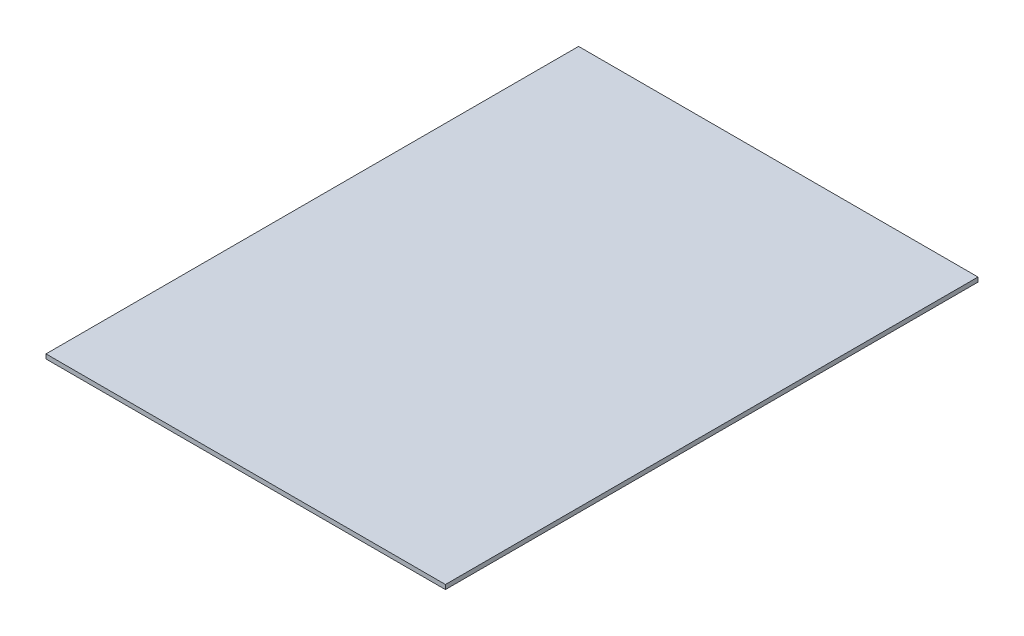
ISO-10303-21;
HEADER;
FILE_DESCRIPTION(('STEP AP214'),'2;1');
FILE_NAME('part.step','',(''),(''),'','','');
FILE_SCHEMA(('AUTOMOTIVE_DESIGN { 1 0 10303 214 1 1 1 1 }'));
ENDSEC;
DATA;
#1=APPLICATION_CONTEXT('core data for automotive mechanical design processes');
#2=APPLICATION_PROTOCOL_DEFINITION('international standard','automotive_design',2000,#1);
#3=PRODUCT_CONTEXT('',#1,'mechanical');
#4=PRODUCT('Part','Part','',(#3));
#5=PRODUCT_RELATED_PRODUCT_CATEGORY('part','',(#4));
#6=PRODUCT_DEFINITION_FORMATION('','',#4);
#7=PRODUCT_DEFINITION_CONTEXT('part definition',#1,'design');
#8=PRODUCT_DEFINITION('design','',#6,#7);
#9=PRODUCT_DEFINITION_SHAPE('','',#8);
#10=(LENGTH_UNIT() NAMED_UNIT(*) SI_UNIT(.MILLI.,.METRE.));
#11=(NAMED_UNIT(*) PLANE_ANGLE_UNIT() SI_UNIT($,.RADIAN.));
#12=(NAMED_UNIT(*) SI_UNIT($,.STERADIAN.) SOLID_ANGLE_UNIT());
#13=UNCERTAINTY_MEASURE_WITH_UNIT(LENGTH_MEASURE(1.E-05),#10,'distance_accuracy_value','');
#14=(GEOMETRIC_REPRESENTATION_CONTEXT(3) GLOBAL_UNCERTAINTY_ASSIGNED_CONTEXT((#13)) GLOBAL_UNIT_ASSIGNED_CONTEXT((#10,
#11,#12)) REPRESENTATION_CONTEXT('',''));
#15=CARTESIAN_POINT('',(0.,0.,0.));
#16=DIRECTION('',(0.,0.,1.));
#17=DIRECTION('',(1.,0.,0.));
#18=AXIS2_PLACEMENT_3D('',#15,#16,#17);
#19=CARTESIAN_POINT('',(-45.,1.,60.));
#20=DIRECTION('',(1.,0.,0.));
#21=DIRECTION('',(0.,0.,-1.));
#22=AXIS2_PLACEMENT_3D('',#19,#20,#21);
#23=PLANE('',#22);
#24=DIRECTION('',(0.,0.,1.));
#25=VECTOR('',#24,1.);
#26=CARTESIAN_POINT('',(-45.,0.,60.));
#27=LINE('',#26,#25);
#28=CARTESIAN_POINT('',(-45.,0.,-60.));
#29=VERTEX_POINT('',#28);
#30=CARTESIAN_POINT('',(-45.,0.,60.));
#31=VERTEX_POINT('',#30);
#32=EDGE_CURVE('E107',#29,#31,#27,.T.);
#33=ORIENTED_EDGE('',*,*,#32,.T.);
#34=DIRECTION('',(0.,-1.,0.));
#35=VECTOR('',#34,1.);
#36=CARTESIAN_POINT('',(-45.,1.,60.));
#37=LINE('',#36,#35);
#38=CARTESIAN_POINT('',(-45.,1.,60.));
#39=VERTEX_POINT('',#38);
#40=EDGE_CURVE('E11',#39,#31,#37,.T.);
#41=ORIENTED_EDGE('',*,*,#40,.F.);
#42=DIRECTION('',(0.,0.,1.));
#43=VECTOR('',#42,1.);
#44=CARTESIAN_POINT('',(-45.,1.,60.));
#45=LINE('',#44,#43);
#46=CARTESIAN_POINT('',(-45.,1.,-60.));
#47=VERTEX_POINT('',#46);
#48=EDGE_CURVE('E91',#47,#39,#45,.T.);
#49=ORIENTED_EDGE('',*,*,#48,.F.);
#50=DIRECTION('',(0.,-1.,0.));
#51=VECTOR('',#50,1.);
#52=CARTESIAN_POINT('',(-45.,1.,-60.));
#53=LINE('',#52,#51);
#54=EDGE_CURVE('E103',#47,#29,#53,.T.);
#55=ORIENTED_EDGE('',*,*,#54,.T.);
#56=EDGE_LOOP('',(#33,#41,#49,#55));
#57=FACE_BOUND('',#56,.T.);
#58=ADVANCED_FACE('F39',(#57),#23,.F.);
#59=CARTESIAN_POINT('',(45.,1.,60.));
#60=DIRECTION('',(0.,0.,-1.));
#61=DIRECTION('',(-1.,0.,0.));
#62=AXIS2_PLACEMENT_3D('',#59,#60,#61);
#63=PLANE('',#62);
#64=DIRECTION('',(1.,0.,0.));
#65=VECTOR('',#64,1.);
#66=CARTESIAN_POINT('',(45.,0.,60.));
#67=LINE('',#66,#65);
#68=CARTESIAN_POINT('',(45.,0.,60.));
#69=VERTEX_POINT('',#68);
#70=EDGE_CURVE('E96',#31,#69,#67,.T.);
#71=ORIENTED_EDGE('',*,*,#70,.T.);
#72=DIRECTION('',(0.,-1.,0.));
#73=VECTOR('',#72,1.);
#74=CARTESIAN_POINT('',(45.,1.,60.));
#75=LINE('',#74,#73);
#76=CARTESIAN_POINT('',(45.,1.,60.));
#77=VERTEX_POINT('',#76);
#78=EDGE_CURVE('E48',#77,#69,#75,.T.);
#79=ORIENTED_EDGE('',*,*,#78,.F.);
#80=DIRECTION('',(1.,0.,0.));
#81=VECTOR('',#80,1.);
#82=CARTESIAN_POINT('',(45.,1.,60.));
#83=LINE('',#82,#81);
#84=EDGE_CURVE('E86',#39,#77,#83,.T.);
#85=ORIENTED_EDGE('',*,*,#84,.F.);
#86=ORIENTED_EDGE('',*,*,#40,.T.);
#87=EDGE_LOOP('',(#71,#79,#85,#86));
#88=FACE_BOUND('',#87,.T.);
#89=ADVANCED_FACE('F95',(#88),#63,.F.);
#90=CARTESIAN_POINT('',(45.,1.,60.));
#91=DIRECTION('',(-1.,0.,0.));
#92=DIRECTION('',(0.,0.,1.));
#93=AXIS2_PLACEMENT_3D('',#90,#91,#92);
#94=PLANE('',#93);
#95=DIRECTION('',(0.,0.,-1.));
#96=VECTOR('',#95,1.);
#97=CARTESIAN_POINT('',(45.,0.,60.));
#98=LINE('',#97,#96);
#99=CARTESIAN_POINT('',(45.,0.,-60.));
#100=VERTEX_POINT('',#99);
#101=EDGE_CURVE('E73',#69,#100,#98,.T.);
#102=ORIENTED_EDGE('',*,*,#101,.T.);
#103=DIRECTION('',(0.,-1.,0.));
#104=VECTOR('',#103,1.);
#105=CARTESIAN_POINT('',(45.,1.,-60.));
#106=LINE('',#105,#104);
#107=CARTESIAN_POINT('',(45.,1.,-60.));
#108=VERTEX_POINT('',#107);
#109=EDGE_CURVE('E98',#108,#100,#106,.T.);
#110=ORIENTED_EDGE('',*,*,#109,.F.);
#111=DIRECTION('',(0.,0.,-1.));
#112=VECTOR('',#111,1.);
#113=CARTESIAN_POINT('',(45.,1.,60.));
#114=LINE('',#113,#112);
#115=EDGE_CURVE('E89',#77,#108,#114,.T.);
#116=ORIENTED_EDGE('',*,*,#115,.F.);
#117=ORIENTED_EDGE('',*,*,#78,.T.);
#118=EDGE_LOOP('',(#102,#110,#116,#117));
#119=FACE_BOUND('',#118,.T.);
#120=ADVANCED_FACE('F99',(#119),#94,.F.);
#121=CARTESIAN_POINT('',(45.,1.,-60.));
#122=DIRECTION('',(0.,0.,1.));
#123=DIRECTION('',(1.,0.,0.));
#124=AXIS2_PLACEMENT_3D('',#121,#122,#123);
#125=PLANE('',#124);
#126=DIRECTION('',(-1.,0.,0.));
#127=VECTOR('',#126,1.);
#128=CARTESIAN_POINT('',(45.,0.,-60.));
#129=LINE('',#128,#127);
#130=EDGE_CURVE('E79',#100,#29,#129,.T.);
#131=ORIENTED_EDGE('',*,*,#130,.T.);
#132=ORIENTED_EDGE('',*,*,#54,.F.);
#133=DIRECTION('',(-1.,0.,0.));
#134=VECTOR('',#133,1.);
#135=CARTESIAN_POINT('',(45.,1.,-60.));
#136=LINE('',#135,#134);
#137=EDGE_CURVE('E56',#108,#47,#136,.T.);
#138=ORIENTED_EDGE('',*,*,#137,.F.);
#139=ORIENTED_EDGE('',*,*,#109,.T.);
#140=EDGE_LOOP('',(#131,#132,#138,#139));
#141=FACE_BOUND('',#140,.T.);
#142=ADVANCED_FACE('F120',(#141),#125,.F.);
#143=CARTESIAN_POINT('',(0.,1.,0.));
#144=DIRECTION('',(0.,1.,0.));
#145=DIRECTION('',(0.,0.,1.));
#146=AXIS2_PLACEMENT_3D('',#143,#144,#145);
#147=PLANE('',#146);
#148=ORIENTED_EDGE('',*,*,#48,.T.);
#149=ORIENTED_EDGE('',*,*,#84,.T.);
#150=ORIENTED_EDGE('',*,*,#115,.T.);
#151=ORIENTED_EDGE('',*,*,#137,.T.);
#152=EDGE_LOOP('',(#148,#149,#150,#151));
#153=FACE_BOUND('',#152,.T.);
#154=ADVANCED_FACE('F87',(#153),#147,.T.);
#155=CARTESIAN_POINT('',(0.,0.,0.));
#156=DIRECTION('',(0.,1.,0.));
#157=DIRECTION('',(0.,0.,1.));
#158=AXIS2_PLACEMENT_3D('',#155,#156,#157);
#159=PLANE('',#158);
#160=ORIENTED_EDGE('',*,*,#32,.F.);
#161=ORIENTED_EDGE('',*,*,#130,.F.);
#162=ORIENTED_EDGE('',*,*,#101,.F.);
#163=ORIENTED_EDGE('',*,*,#70,.F.);
#164=EDGE_LOOP('',(#160,#161,#162,#163));
#165=FACE_BOUND('',#164,.T.);
#166=ADVANCED_FACE('F123',(#165),#159,.F.);
#167=CLOSED_SHELL('',(#58,#89,#120,#142,#154,#166));
#168=MANIFOLD_SOLID_BREP('B2',#167);
#169=ADVANCED_BREP_SHAPE_REPRESENTATION('',(#18,#168),#14);
#170=SHAPE_DEFINITION_REPRESENTATION(#9,#169);
ENDSEC;
END-ISO-10303-21;
